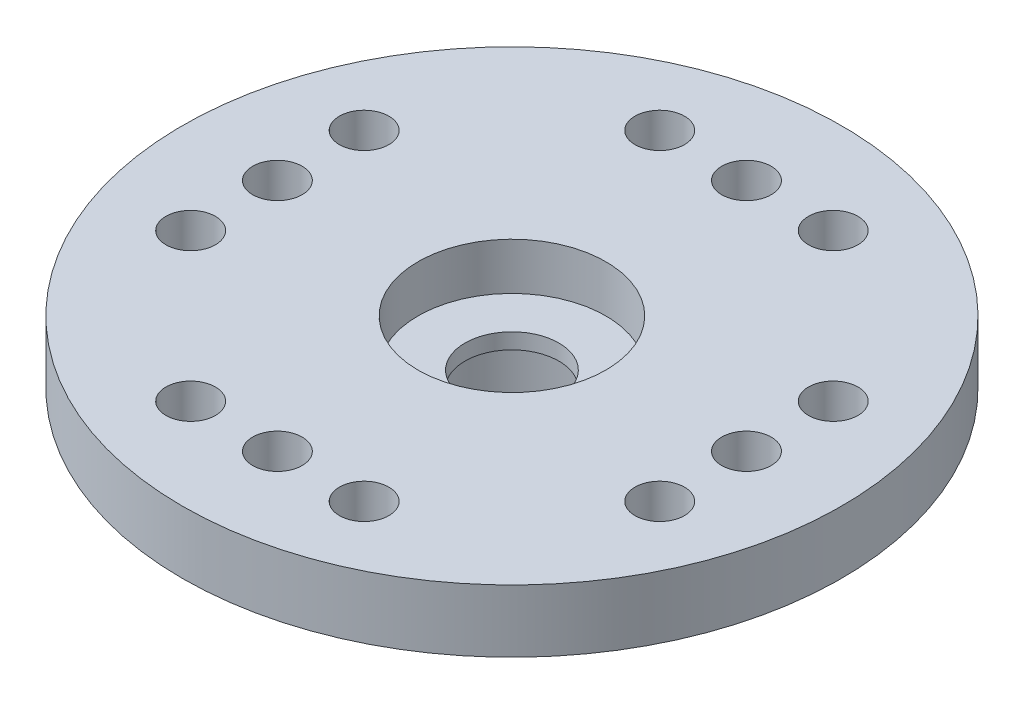
ISO-10303-21;
HEADER;
FILE_DESCRIPTION(('STEP AP214'),'2;1');
FILE_NAME('part.step','',(''),(''),'','','');
FILE_SCHEMA(('AUTOMOTIVE_DESIGN { 1 0 10303 214 1 1 1 1 }'));
ENDSEC;
DATA;
#1=APPLICATION_CONTEXT('core data for automotive mechanical design processes');
#2=APPLICATION_PROTOCOL_DEFINITION('international standard','automotive_design',2000,#1);
#3=PRODUCT_CONTEXT('',#1,'mechanical');
#4=PRODUCT('Part','Part','',(#3));
#5=PRODUCT_RELATED_PRODUCT_CATEGORY('part','',(#4));
#6=PRODUCT_DEFINITION_FORMATION('','',#4);
#7=PRODUCT_DEFINITION_CONTEXT('part definition',#1,'design');
#8=PRODUCT_DEFINITION('design','',#6,#7);
#9=PRODUCT_DEFINITION_SHAPE('','',#8);
#10=(LENGTH_UNIT() NAMED_UNIT(*) SI_UNIT(.MILLI.,.METRE.));
#11=(NAMED_UNIT(*) PLANE_ANGLE_UNIT() SI_UNIT($,.RADIAN.));
#12=(NAMED_UNIT(*) SI_UNIT($,.STERADIAN.) SOLID_ANGLE_UNIT());
#13=UNCERTAINTY_MEASURE_WITH_UNIT(LENGTH_MEASURE(1.E-05),#10,'distance_accuracy_value','');
#14=(GEOMETRIC_REPRESENTATION_CONTEXT(3) GLOBAL_UNCERTAINTY_ASSIGNED_CONTEXT((#13)) GLOBAL_UNIT_ASSIGNED_CONTEXT((#10,
#11,#12)) REPRESENTATION_CONTEXT('',''));
#15=CARTESIAN_POINT('',(0.,0.,0.));
#16=DIRECTION('',(0.,0.,1.));
#17=DIRECTION('',(1.,0.,0.));
#18=AXIS2_PLACEMENT_3D('',#15,#16,#17);
#19=CARTESIAN_POINT('',(0.,0.,0.));
#20=DIRECTION('',(0.,1.,0.));
#21=DIRECTION('',(0.,0.,1.));
#22=AXIS2_PLACEMENT_3D('',#19,#20,#21);
#23=CYLINDRICAL_SURFACE('',#22,1.5);
#24=CARTESIAN_POINT('',(0.,0.,0.));
#25=DIRECTION('',(0.,1.,0.));
#26=DIRECTION('',(0.,0.,1.));
#27=AXIS2_PLACEMENT_3D('',#24,#25,#26);
#28=CIRCLE('',#27,1.5);
#29=CARTESIAN_POINT('',(0.,0.,1.5));
#30=VERTEX_POINT('',#29);
#31=EDGE_CURVE('E57',#30,#30,#28,.T.);
#32=ORIENTED_EDGE('',*,*,#31,.F.);
#33=EDGE_LOOP('',(#32));
#34=FACE_BOUND('',#33,.T.);
#35=CARTESIAN_POINT('',(0.,0.5,0.));
#36=DIRECTION('',(0.,1.,0.));
#37=DIRECTION('',(0.,0.,1.));
#38=AXIS2_PLACEMENT_3D('',#35,#36,#37);
#39=CIRCLE('',#38,1.5);
#40=CARTESIAN_POINT('',(0.,0.5,1.5));
#41=VERTEX_POINT('',#40);
#42=EDGE_CURVE('E37',#41,#41,#39,.F.);
#43=ORIENTED_EDGE('',*,*,#42,.F.);
#44=EDGE_LOOP('',(#43));
#45=FACE_BOUND('',#44,.T.);
#46=ADVANCED_FACE('F33',(#34,#45),#23,.F.);
#47=CARTESIAN_POINT('',(0.,0.,0.));
#48=DIRECTION('',(0.,1.,0.));
#49=DIRECTION('',(0.,0.,1.));
#50=AXIS2_PLACEMENT_3D('',#47,#48,#49);
#51=PLANE('',#50);
#52=CARTESIAN_POINT('',(-7.49,0.,2.77));
#53=DIRECTION('',(0.,1.,0.));
#54=DIRECTION('',(0.,0.,1.));
#55=AXIS2_PLACEMENT_3D('',#52,#53,#54);
#56=CIRCLE('',#55,0.79);
#57=CARTESIAN_POINT('',(-7.49,0.,3.56));
#58=VERTEX_POINT('',#57);
#59=EDGE_CURVE('E132',#58,#58,#56,.T.);
#60=ORIENTED_EDGE('',*,*,#59,.T.);
#61=EDGE_LOOP('',(#60));
#62=FACE_BOUND('',#61,.T.);
#63=CARTESIAN_POINT('',(-7.49,0.,-2.77));
#64=DIRECTION('',(0.,1.,0.));
#65=DIRECTION('',(0.,0.,1.));
#66=AXIS2_PLACEMENT_3D('',#63,#64,#65);
#67=CIRCLE('',#66,0.79);
#68=CARTESIAN_POINT('',(-7.49,0.,-1.98));
#69=VERTEX_POINT('',#68);
#70=EDGE_CURVE('E126',#69,#69,#67,.T.);
#71=ORIENTED_EDGE('',*,*,#70,.T.);
#72=EDGE_LOOP('',(#71));
#73=FACE_BOUND('',#72,.T.);
#74=CARTESIAN_POINT('',(-7.49,0.,0.));
#75=DIRECTION('',(0.,1.,0.));
#76=DIRECTION('',(0.,0.,1.));
#77=AXIS2_PLACEMENT_3D('',#74,#75,#76);
#78=CIRCLE('',#77,0.79);
#79=CARTESIAN_POINT('',(-7.49,0.,0.79));
#80=VERTEX_POINT('',#79);
#81=EDGE_CURVE('E120',#80,#80,#78,.T.);
#82=ORIENTED_EDGE('',*,*,#81,.T.);
#83=EDGE_LOOP('',(#82));
#84=FACE_BOUND('',#83,.T.);
#85=CARTESIAN_POINT('',(-2.77,0.,7.49));
#86=DIRECTION('',(0.,1.,0.));
#87=DIRECTION('',(0.,0.,1.));
#88=AXIS2_PLACEMENT_3D('',#85,#86,#87);
#89=CIRCLE('',#88,0.79);
#90=CARTESIAN_POINT('',(-2.77,0.,8.28));
#91=VERTEX_POINT('',#90);
#92=EDGE_CURVE('E114',#91,#91,#89,.T.);
#93=ORIENTED_EDGE('',*,*,#92,.T.);
#94=EDGE_LOOP('',(#93));
#95=FACE_BOUND('',#94,.T.);
#96=CARTESIAN_POINT('',(2.77,0.,7.49));
#97=DIRECTION('',(0.,1.,0.));
#98=DIRECTION('',(0.,0.,1.));
#99=AXIS2_PLACEMENT_3D('',#96,#97,#98);
#100=CIRCLE('',#99,0.79);
#101=CARTESIAN_POINT('',(2.77,0.,8.28));
#102=VERTEX_POINT('',#101);
#103=EDGE_CURVE('E108',#102,#102,#100,.T.);
#104=ORIENTED_EDGE('',*,*,#103,.T.);
#105=EDGE_LOOP('',(#104));
#106=FACE_BOUND('',#105,.T.);
#107=CARTESIAN_POINT('',(0.,0.,7.49));
#108=DIRECTION('',(0.,1.,0.));
#109=DIRECTION('',(0.,0.,1.));
#110=AXIS2_PLACEMENT_3D('',#107,#108,#109);
#111=CIRCLE('',#110,0.79);
#112=CARTESIAN_POINT('',(0.,0.,8.28));
#113=VERTEX_POINT('',#112);
#114=EDGE_CURVE('E102',#113,#113,#111,.T.);
#115=ORIENTED_EDGE('',*,*,#114,.T.);
#116=EDGE_LOOP('',(#115));
#117=FACE_BOUND('',#116,.T.);
#118=CARTESIAN_POINT('',(7.49,0.,-2.77));
#119=DIRECTION('',(0.,1.,0.));
#120=DIRECTION('',(0.,0.,1.));
#121=AXIS2_PLACEMENT_3D('',#118,#119,#120);
#122=CIRCLE('',#121,0.790000000000001);
#123=CARTESIAN_POINT('',(7.49,0.,-1.98));
#124=VERTEX_POINT('',#123);
#125=EDGE_CURVE('E96',#124,#124,#122,.T.);
#126=ORIENTED_EDGE('',*,*,#125,.T.);
#127=EDGE_LOOP('',(#126));
#128=FACE_BOUND('',#127,.T.);
#129=CARTESIAN_POINT('',(7.49,0.,2.77));
#130=DIRECTION('',(0.,1.,0.));
#131=DIRECTION('',(0.,0.,1.));
#132=AXIS2_PLACEMENT_3D('',#129,#130,#131);
#133=CIRCLE('',#132,0.790000000000001);
#134=CARTESIAN_POINT('',(7.49,0.,3.56));
#135=VERTEX_POINT('',#134);
#136=EDGE_CURVE('E90',#135,#135,#133,.T.);
#137=ORIENTED_EDGE('',*,*,#136,.T.);
#138=EDGE_LOOP('',(#137));
#139=FACE_BOUND('',#138,.T.);
#140=CARTESIAN_POINT('',(7.49,0.,0.));
#141=DIRECTION('',(0.,1.,0.));
#142=DIRECTION('',(0.,0.,1.));
#143=AXIS2_PLACEMENT_3D('',#140,#141,#142);
#144=CIRCLE('',#143,0.790000000000001);
#145=CARTESIAN_POINT('',(7.49,0.,0.790000000000001));
#146=VERTEX_POINT('',#145);
#147=EDGE_CURVE('E84',#146,#146,#144,.T.);
#148=ORIENTED_EDGE('',*,*,#147,.T.);
#149=EDGE_LOOP('',(#148));
#150=FACE_BOUND('',#149,.T.);
#151=CARTESIAN_POINT('',(-2.77,0.,-7.49));
#152=DIRECTION('',(0.,1.,0.));
#153=DIRECTION('',(0.,0.,1.));
#154=AXIS2_PLACEMENT_3D('',#151,#152,#153);
#155=CIRCLE('',#154,0.79);
#156=CARTESIAN_POINT('',(-2.77,0.,-6.7));
#157=VERTEX_POINT('',#156);
#158=EDGE_CURVE('E78',#157,#157,#155,.T.);
#159=ORIENTED_EDGE('',*,*,#158,.T.);
#160=EDGE_LOOP('',(#159));
#161=FACE_BOUND('',#160,.T.);
#162=CARTESIAN_POINT('',(2.77,0.,-7.49));
#163=DIRECTION('',(0.,1.,0.));
#164=DIRECTION('',(0.,0.,1.));
#165=AXIS2_PLACEMENT_3D('',#162,#163,#164);
#166=CIRCLE('',#165,0.79);
#167=CARTESIAN_POINT('',(2.77,0.,-6.7));
#168=VERTEX_POINT('',#167);
#169=EDGE_CURVE('E72',#168,#168,#166,.T.);
#170=ORIENTED_EDGE('',*,*,#169,.T.);
#171=EDGE_LOOP('',(#170));
#172=FACE_BOUND('',#171,.T.);
#173=CARTESIAN_POINT('',(0.,0.,-7.49));
#174=DIRECTION('',(0.,1.,0.));
#175=DIRECTION('',(0.,0.,1.));
#176=AXIS2_PLACEMENT_3D('',#173,#174,#175);
#177=CIRCLE('',#176,0.79);
#178=CARTESIAN_POINT('',(0.,0.,-6.7));
#179=VERTEX_POINT('',#178);
#180=EDGE_CURVE('E66',#179,#179,#177,.T.);
#181=ORIENTED_EDGE('',*,*,#180,.T.);
#182=EDGE_LOOP('',(#181));
#183=FACE_BOUND('',#182,.T.);
#184=CARTESIAN_POINT('',(0.,0.,0.));
#185=DIRECTION('',(0.,1.,0.));
#186=DIRECTION('',(0.,0.,1.));
#187=AXIS2_PLACEMENT_3D('',#184,#185,#186);
#188=CIRCLE('',#187,10.525);
#189=CARTESIAN_POINT('',(0.,0.,10.525));
#190=VERTEX_POINT('',#189);
#191=EDGE_CURVE('E45',#190,#190,#188,.T.);
#192=ORIENTED_EDGE('',*,*,#191,.F.);
#193=EDGE_LOOP('',(#192));
#194=FACE_BOUND('',#193,.T.);
#195=CARTESIAN_POINT('',(0.,0.,0.));
#196=DIRECTION('',(0.,1.,0.));
#197=DIRECTION('',(0.,0.,1.));
#198=AXIS2_PLACEMENT_3D('',#195,#196,#197);
#199=CIRCLE('',#198,4.1);
#200=CARTESIAN_POINT('',(0.,0.,4.1));
#201=VERTEX_POINT('',#200);
#202=EDGE_CURVE('E10',#201,#201,#199,.F.);
#203=ORIENTED_EDGE('',*,*,#202,.F.);
#204=EDGE_LOOP('',(#203));
#205=FACE_BOUND('',#204,.T.);
#206=ADVANCED_FACE('F141',(#62,#73,#84,#95,#106,#117,#128,#139,#150,#161,#172,#183,#194,#205),
#51,.F.);
#207=CARTESIAN_POINT('',(0.,2.,0.));
#208=DIRECTION('',(0.,-1.,0.));
#209=DIRECTION('',(0.,0.,-1.));
#210=AXIS2_PLACEMENT_3D('',#207,#208,#209);
#211=CYLINDRICAL_SURFACE('',#210,10.525);
#212=CARTESIAN_POINT('',(0.,2.,0.));
#213=DIRECTION('',(0.,1.,0.));
#214=DIRECTION('',(0.,0.,1.));
#215=AXIS2_PLACEMENT_3D('',#212,#213,#214);
#216=CIRCLE('',#215,10.525);
#217=CARTESIAN_POINT('',(0.,2.,10.525));
#218=VERTEX_POINT('',#217);
#219=EDGE_CURVE('E41',#218,#218,#216,.T.);
#220=ORIENTED_EDGE('',*,*,#219,.F.);
#221=EDGE_LOOP('',(#220));
#222=FACE_BOUND('',#221,.T.);
#223=ORIENTED_EDGE('',*,*,#191,.T.);
#224=EDGE_LOOP('',(#223));
#225=FACE_BOUND('',#224,.T.);
#226=ADVANCED_FACE('F35',(#222,#225),#211,.T.);
#227=CARTESIAN_POINT('',(0.,2.,0.));
#228=DIRECTION('',(0.,1.,0.));
#229=DIRECTION('',(0.,0.,1.));
#230=AXIS2_PLACEMENT_3D('',#227,#228,#229);
#231=PLANE('',#230);
#232=CARTESIAN_POINT('',(-7.49,2.,2.77));
#233=DIRECTION('',(0.,1.,0.));
#234=DIRECTION('',(0.,0.,1.));
#235=AXIS2_PLACEMENT_3D('',#232,#233,#234);
#236=CIRCLE('',#235,0.79);
#237=CARTESIAN_POINT('',(-7.49,2.,3.56));
#238=VERTEX_POINT('',#237);
#239=EDGE_CURVE('E135',#238,#238,#236,.T.);
#240=ORIENTED_EDGE('',*,*,#239,.F.);
#241=EDGE_LOOP('',(#240));
#242=FACE_BOUND('',#241,.T.);
#243=CARTESIAN_POINT('',(-7.49,2.,-2.77));
#244=DIRECTION('',(0.,1.,0.));
#245=DIRECTION('',(0.,0.,1.));
#246=AXIS2_PLACEMENT_3D('',#243,#244,#245);
#247=CIRCLE('',#246,0.79);
#248=CARTESIAN_POINT('',(-7.49,2.,-1.98));
#249=VERTEX_POINT('',#248);
#250=EDGE_CURVE('E129',#249,#249,#247,.T.);
#251=ORIENTED_EDGE('',*,*,#250,.F.);
#252=EDGE_LOOP('',(#251));
#253=FACE_BOUND('',#252,.T.);
#254=CARTESIAN_POINT('',(-7.49,2.,0.));
#255=DIRECTION('',(0.,1.,0.));
#256=DIRECTION('',(0.,0.,1.));
#257=AXIS2_PLACEMENT_3D('',#254,#255,#256);
#258=CIRCLE('',#257,0.79);
#259=CARTESIAN_POINT('',(-7.49,2.,0.79));
#260=VERTEX_POINT('',#259);
#261=EDGE_CURVE('E123',#260,#260,#258,.T.);
#262=ORIENTED_EDGE('',*,*,#261,.F.);
#263=EDGE_LOOP('',(#262));
#264=FACE_BOUND('',#263,.T.);
#265=CARTESIAN_POINT('',(-2.77,2.,7.49));
#266=DIRECTION('',(0.,1.,0.));
#267=DIRECTION('',(0.,0.,1.));
#268=AXIS2_PLACEMENT_3D('',#265,#266,#267);
#269=CIRCLE('',#268,0.79);
#270=CARTESIAN_POINT('',(-2.77,2.,8.28));
#271=VERTEX_POINT('',#270);
#272=EDGE_CURVE('E117',#271,#271,#269,.T.);
#273=ORIENTED_EDGE('',*,*,#272,.F.);
#274=EDGE_LOOP('',(#273));
#275=FACE_BOUND('',#274,.T.);
#276=CARTESIAN_POINT('',(2.77,2.,7.49));
#277=DIRECTION('',(0.,1.,0.));
#278=DIRECTION('',(0.,0.,1.));
#279=AXIS2_PLACEMENT_3D('',#276,#277,#278);
#280=CIRCLE('',#279,0.79);
#281=CARTESIAN_POINT('',(2.77,2.,8.28));
#282=VERTEX_POINT('',#281);
#283=EDGE_CURVE('E111',#282,#282,#280,.T.);
#284=ORIENTED_EDGE('',*,*,#283,.F.);
#285=EDGE_LOOP('',(#284));
#286=FACE_BOUND('',#285,.T.);
#287=CARTESIAN_POINT('',(0.,2.,7.49));
#288=DIRECTION('',(0.,1.,0.));
#289=DIRECTION('',(0.,0.,1.));
#290=AXIS2_PLACEMENT_3D('',#287,#288,#289);
#291=CIRCLE('',#290,0.79);
#292=CARTESIAN_POINT('',(0.,2.,8.28));
#293=VERTEX_POINT('',#292);
#294=EDGE_CURVE('E105',#293,#293,#291,.T.);
#295=ORIENTED_EDGE('',*,*,#294,.F.);
#296=EDGE_LOOP('',(#295));
#297=FACE_BOUND('',#296,.T.);
#298=CARTESIAN_POINT('',(7.49,2.,-2.77));
#299=DIRECTION('',(0.,1.,0.));
#300=DIRECTION('',(0.,0.,1.));
#301=AXIS2_PLACEMENT_3D('',#298,#299,#300);
#302=CIRCLE('',#301,0.790000000000001);
#303=CARTESIAN_POINT('',(7.49,2.,-1.98));
#304=VERTEX_POINT('',#303);
#305=EDGE_CURVE('E99',#304,#304,#302,.T.);
#306=ORIENTED_EDGE('',*,*,#305,.F.);
#307=EDGE_LOOP('',(#306));
#308=FACE_BOUND('',#307,.T.);
#309=CARTESIAN_POINT('',(7.49,2.,2.77));
#310=DIRECTION('',(0.,1.,0.));
#311=DIRECTION('',(0.,0.,1.));
#312=AXIS2_PLACEMENT_3D('',#309,#310,#311);
#313=CIRCLE('',#312,0.790000000000001);
#314=CARTESIAN_POINT('',(7.49,2.,3.56));
#315=VERTEX_POINT('',#314);
#316=EDGE_CURVE('E93',#315,#315,#313,.T.);
#317=ORIENTED_EDGE('',*,*,#316,.F.);
#318=EDGE_LOOP('',(#317));
#319=FACE_BOUND('',#318,.T.);
#320=CARTESIAN_POINT('',(7.49,2.,0.));
#321=DIRECTION('',(0.,1.,0.));
#322=DIRECTION('',(0.,0.,1.));
#323=AXIS2_PLACEMENT_3D('',#320,#321,#322);
#324=CIRCLE('',#323,0.790000000000001);
#325=CARTESIAN_POINT('',(7.49,2.,0.790000000000001));
#326=VERTEX_POINT('',#325);
#327=EDGE_CURVE('E87',#326,#326,#324,.T.);
#328=ORIENTED_EDGE('',*,*,#327,.F.);
#329=EDGE_LOOP('',(#328));
#330=FACE_BOUND('',#329,.T.);
#331=CARTESIAN_POINT('',(-2.77,2.,-7.49));
#332=DIRECTION('',(0.,1.,0.));
#333=DIRECTION('',(0.,0.,1.));
#334=AXIS2_PLACEMENT_3D('',#331,#332,#333);
#335=CIRCLE('',#334,0.79);
#336=CARTESIAN_POINT('',(-2.77,2.,-6.7));
#337=VERTEX_POINT('',#336);
#338=EDGE_CURVE('E81',#337,#337,#335,.T.);
#339=ORIENTED_EDGE('',*,*,#338,.F.);
#340=EDGE_LOOP('',(#339));
#341=FACE_BOUND('',#340,.T.);
#342=CARTESIAN_POINT('',(2.77,2.,-7.49));
#343=DIRECTION('',(0.,1.,0.));
#344=DIRECTION('',(0.,0.,1.));
#345=AXIS2_PLACEMENT_3D('',#342,#343,#344);
#346=CIRCLE('',#345,0.79);
#347=CARTESIAN_POINT('',(2.77,2.,-6.7));
#348=VERTEX_POINT('',#347);
#349=EDGE_CURVE('E75',#348,#348,#346,.T.);
#350=ORIENTED_EDGE('',*,*,#349,.F.);
#351=EDGE_LOOP('',(#350));
#352=FACE_BOUND('',#351,.T.);
#353=CARTESIAN_POINT('',(0.,2.,-7.49));
#354=DIRECTION('',(0.,1.,0.));
#355=DIRECTION('',(0.,0.,1.));
#356=AXIS2_PLACEMENT_3D('',#353,#354,#355);
#357=CIRCLE('',#356,0.79);
#358=CARTESIAN_POINT('',(0.,2.,-6.7));
#359=VERTEX_POINT('',#358);
#360=EDGE_CURVE('E69',#359,#359,#357,.T.);
#361=ORIENTED_EDGE('',*,*,#360,.F.);
#362=EDGE_LOOP('',(#361));
#363=FACE_BOUND('',#362,.T.);
#364=CARTESIAN_POINT('',(0.,2.,0.));
#365=DIRECTION('',(0.,1.,0.));
#366=DIRECTION('',(0.,0.,1.));
#367=AXIS2_PLACEMENT_3D('',#364,#365,#366);
#368=CIRCLE('',#367,3.);
#369=CARTESIAN_POINT('',(0.,2.,3.));
#370=VERTEX_POINT('',#369);
#371=EDGE_CURVE('E62',#370,#370,#368,.T.);
#372=ORIENTED_EDGE('',*,*,#371,.F.);
#373=EDGE_LOOP('',(#372));
#374=FACE_BOUND('',#373,.T.);
#375=ORIENTED_EDGE('',*,*,#219,.T.);
#376=EDGE_LOOP('',(#375));
#377=FACE_BOUND('',#376,.T.);
#378=ADVANCED_FACE('F151',(#242,#253,#264,#275,#286,#297,#308,#319,#330,#341,#352,#363,#374,
#377),#231,.T.);
#379=CARTESIAN_POINT('',(0.,-3.7,0.));
#380=DIRECTION('',(0.,1.,0.));
#381=DIRECTION('',(0.,0.,1.));
#382=AXIS2_PLACEMENT_3D('',#379,#380,#381);
#383=CYLINDRICAL_SURFACE('',#382,4.1);
#384=CARTESIAN_POINT('',(0.,-3.7,0.));
#385=DIRECTION('',(0.,-1.,0.));
#386=DIRECTION('',(0.,0.,-1.));
#387=AXIS2_PLACEMENT_3D('',#384,#385,#386);
#388=CIRCLE('',#387,4.1);
#389=CARTESIAN_POINT('',(0.,-3.7,-4.1));
#390=VERTEX_POINT('',#389);
#391=EDGE_CURVE('E49',#390,#390,#388,.T.);
#392=ORIENTED_EDGE('',*,*,#391,.F.);
#393=EDGE_LOOP('',(#392));
#394=FACE_BOUND('',#393,.T.);
#395=ORIENTED_EDGE('',*,*,#202,.T.);
#396=EDGE_LOOP('',(#395));
#397=FACE_BOUND('',#396,.T.);
#398=ADVANCED_FACE('F154',(#394,#397),#383,.T.);
#399=CARTESIAN_POINT('',(0.,-3.7,0.));
#400=DIRECTION('',(0.,-1.,0.));
#401=DIRECTION('',(0.,0.,-1.));
#402=AXIS2_PLACEMENT_3D('',#399,#400,#401);
#403=PLANE('',#402);
#404=CARTESIAN_POINT('',(0.,-3.7,0.));
#405=DIRECTION('',(0.,-1.,0.));
#406=DIRECTION('',(0.,0.,-1.));
#407=AXIS2_PLACEMENT_3D('',#404,#405,#406);
#408=CIRCLE('',#407,2.97);
#409=CARTESIAN_POINT('',(0.,-3.7,-2.97));
#410=VERTEX_POINT('',#409);
#411=EDGE_CURVE('E54',#410,#410,#408,.T.);
#412=ORIENTED_EDGE('',*,*,#411,.F.);
#413=EDGE_LOOP('',(#412));
#414=FACE_BOUND('',#413,.T.);
#415=ORIENTED_EDGE('',*,*,#391,.T.);
#416=EDGE_LOOP('',(#415));
#417=FACE_BOUND('',#416,.T.);
#418=ADVANCED_FACE('F196',(#414,#417),#403,.T.);
#419=CARTESIAN_POINT('',(0.,0.,0.));
#420=DIRECTION('',(0.,-1.,0.));
#421=DIRECTION('',(0.,0.,-1.));
#422=AXIS2_PLACEMENT_3D('',#419,#420,#421);
#423=CYLINDRICAL_SURFACE('',#422,2.97);
#424=CARTESIAN_POINT('',(0.,0.,0.));
#425=DIRECTION('',(0.,-1.,0.));
#426=DIRECTION('',(0.,0.,-1.));
#427=AXIS2_PLACEMENT_3D('',#424,#425,#426);
#428=CIRCLE('',#427,2.97);
#429=CARTESIAN_POINT('',(0.,0.,-2.97));
#430=VERTEX_POINT('',#429);
#431=EDGE_CURVE('E53',#430,#430,#428,.T.);
#432=ORIENTED_EDGE('',*,*,#431,.F.);
#433=EDGE_LOOP('',(#432));
#434=FACE_BOUND('',#433,.T.);
#435=ORIENTED_EDGE('',*,*,#411,.T.);
#436=EDGE_LOOP('',(#435));
#437=FACE_BOUND('',#436,.T.);
#438=ADVANCED_FACE('F200',(#434,#437),#423,.F.);
#439=CARTESIAN_POINT('',(0.,0.,0.));
#440=DIRECTION('',(0.,-1.,0.));
#441=DIRECTION('',(0.,0.,-1.));
#442=AXIS2_PLACEMENT_3D('',#439,#440,#441);
#443=PLANE('',#442);
#444=ORIENTED_EDGE('',*,*,#31,.T.);
#445=EDGE_LOOP('',(#444));
#446=FACE_BOUND('',#445,.T.);
#447=ORIENTED_EDGE('',*,*,#431,.T.);
#448=EDGE_LOOP('',(#447));
#449=FACE_BOUND('',#448,.T.);
#450=ADVANCED_FACE('F204',(#446,#449),#443,.T.);
#451=CARTESIAN_POINT('',(0.,0.5,0.));
#452=DIRECTION('',(0.,1.,0.));
#453=DIRECTION('',(0.,0.,1.));
#454=AXIS2_PLACEMENT_3D('',#451,#452,#453);
#455=PLANE('',#454);
#456=CARTESIAN_POINT('',(0.,0.5,0.));
#457=DIRECTION('',(0.,1.,0.));
#458=DIRECTION('',(0.,0.,1.));
#459=AXIS2_PLACEMENT_3D('',#456,#457,#458);
#460=CIRCLE('',#459,3.);
#461=CARTESIAN_POINT('',(0.,0.5,3.));
#462=VERTEX_POINT('',#461);
#463=EDGE_CURVE('E65',#462,#462,#460,.T.);
#464=ORIENTED_EDGE('',*,*,#463,.T.);
#465=EDGE_LOOP('',(#464));
#466=FACE_BOUND('',#465,.T.);
#467=ORIENTED_EDGE('',*,*,#42,.T.);
#468=EDGE_LOOP('',(#467));
#469=FACE_BOUND('',#468,.T.);
#470=ADVANCED_FACE('F207',(#466,#469),#455,.T.);
#471=CARTESIAN_POINT('',(0.,0.5,0.));
#472=DIRECTION('',(0.,1.,0.));
#473=DIRECTION('',(0.,0.,1.));
#474=AXIS2_PLACEMENT_3D('',#471,#472,#473);
#475=CYLINDRICAL_SURFACE('',#474,3.);
#476=ORIENTED_EDGE('',*,*,#463,.F.);
#477=EDGE_LOOP('',(#476));
#478=FACE_BOUND('',#477,.T.);
#479=ORIENTED_EDGE('',*,*,#371,.T.);
#480=EDGE_LOOP('',(#479));
#481=FACE_BOUND('',#480,.T.);
#482=ADVANCED_FACE('F210',(#478,#481),#475,.F.);
#483=CARTESIAN_POINT('',(0.,0.,-7.49));
#484=DIRECTION('',(0.,1.,0.));
#485=DIRECTION('',(0.,0.,1.));
#486=AXIS2_PLACEMENT_3D('',#483,#484,#485);
#487=CYLINDRICAL_SURFACE('',#486,0.79);
#488=ORIENTED_EDGE('',*,*,#180,.F.);
#489=EDGE_LOOP('',(#488));
#490=FACE_BOUND('',#489,.T.);
#491=ORIENTED_EDGE('',*,*,#360,.T.);
#492=EDGE_LOOP('',(#491));
#493=FACE_BOUND('',#492,.T.);
#494=ADVANCED_FACE('F213',(#490,#493),#487,.F.);
#495=CARTESIAN_POINT('',(2.77,0.,-7.49));
#496=DIRECTION('',(0.,1.,0.));
#497=DIRECTION('',(0.,0.,1.));
#498=AXIS2_PLACEMENT_3D('',#495,#496,#497);
#499=CYLINDRICAL_SURFACE('',#498,0.79);
#500=ORIENTED_EDGE('',*,*,#169,.F.);
#501=EDGE_LOOP('',(#500));
#502=FACE_BOUND('',#501,.T.);
#503=ORIENTED_EDGE('',*,*,#349,.T.);
#504=EDGE_LOOP('',(#503));
#505=FACE_BOUND('',#504,.T.);
#506=ADVANCED_FACE('F220',(#502,#505),#499,.F.);
#507=CARTESIAN_POINT('',(-2.77,0.,-7.49));
#508=DIRECTION('',(0.,1.,0.));
#509=DIRECTION('',(0.,0.,1.));
#510=AXIS2_PLACEMENT_3D('',#507,#508,#509);
#511=CYLINDRICAL_SURFACE('',#510,0.79);
#512=ORIENTED_EDGE('',*,*,#158,.F.);
#513=EDGE_LOOP('',(#512));
#514=FACE_BOUND('',#513,.T.);
#515=ORIENTED_EDGE('',*,*,#338,.T.);
#516=EDGE_LOOP('',(#515));
#517=FACE_BOUND('',#516,.T.);
#518=ADVANCED_FACE('F224',(#514,#517),#511,.F.);
#519=CARTESIAN_POINT('',(7.49,0.,0.));
#520=DIRECTION('',(0.,1.,0.));
#521=DIRECTION('',(0.,0.,1.));
#522=AXIS2_PLACEMENT_3D('',#519,#520,#521);
#523=CYLINDRICAL_SURFACE('',#522,0.790000000000001);
#524=ORIENTED_EDGE('',*,*,#147,.F.);
#525=EDGE_LOOP('',(#524));
#526=FACE_BOUND('',#525,.T.);
#527=ORIENTED_EDGE('',*,*,#327,.T.);
#528=EDGE_LOOP('',(#527));
#529=FACE_BOUND('',#528,.T.);
#530=ADVANCED_FACE('F228',(#526,#529),#523,.F.);
#531=CARTESIAN_POINT('',(7.49,0.,2.77));
#532=DIRECTION('',(0.,1.,0.));
#533=DIRECTION('',(0.,0.,1.));
#534=AXIS2_PLACEMENT_3D('',#531,#532,#533);
#535=CYLINDRICAL_SURFACE('',#534,0.790000000000001);
#536=ORIENTED_EDGE('',*,*,#136,.F.);
#537=EDGE_LOOP('',(#536));
#538=FACE_BOUND('',#537,.T.);
#539=ORIENTED_EDGE('',*,*,#316,.T.);
#540=EDGE_LOOP('',(#539));
#541=FACE_BOUND('',#540,.T.);
#542=ADVANCED_FACE('F232',(#538,#541),#535,.F.);
#543=CARTESIAN_POINT('',(7.49,0.,-2.77));
#544=DIRECTION('',(0.,1.,0.));
#545=DIRECTION('',(0.,0.,1.));
#546=AXIS2_PLACEMENT_3D('',#543,#544,#545);
#547=CYLINDRICAL_SURFACE('',#546,0.790000000000001);
#548=ORIENTED_EDGE('',*,*,#125,.F.);
#549=EDGE_LOOP('',(#548));
#550=FACE_BOUND('',#549,.T.);
#551=ORIENTED_EDGE('',*,*,#305,.T.);
#552=EDGE_LOOP('',(#551));
#553=FACE_BOUND('',#552,.T.);
#554=ADVANCED_FACE('F236',(#550,#553),#547,.F.);
#555=CARTESIAN_POINT('',(0.,0.,7.49));
#556=DIRECTION('',(0.,1.,0.));
#557=DIRECTION('',(0.,0.,1.));
#558=AXIS2_PLACEMENT_3D('',#555,#556,#557);
#559=CYLINDRICAL_SURFACE('',#558,0.79);
#560=ORIENTED_EDGE('',*,*,#114,.F.);
#561=EDGE_LOOP('',(#560));
#562=FACE_BOUND('',#561,.T.);
#563=ORIENTED_EDGE('',*,*,#294,.T.);
#564=EDGE_LOOP('',(#563));
#565=FACE_BOUND('',#564,.T.);
#566=ADVANCED_FACE('F240',(#562,#565),#559,.F.);
#567=CARTESIAN_POINT('',(2.77,0.,7.49));
#568=DIRECTION('',(0.,1.,0.));
#569=DIRECTION('',(0.,0.,1.));
#570=AXIS2_PLACEMENT_3D('',#567,#568,#569);
#571=CYLINDRICAL_SURFACE('',#570,0.79);
#572=ORIENTED_EDGE('',*,*,#103,.F.);
#573=EDGE_LOOP('',(#572));
#574=FACE_BOUND('',#573,.T.);
#575=ORIENTED_EDGE('',*,*,#283,.T.);
#576=EDGE_LOOP('',(#575));
#577=FACE_BOUND('',#576,.T.);
#578=ADVANCED_FACE('F244',(#574,#577),#571,.F.);
#579=CARTESIAN_POINT('',(-2.77,0.,7.49));
#580=DIRECTION('',(0.,1.,0.));
#581=DIRECTION('',(0.,0.,1.));
#582=AXIS2_PLACEMENT_3D('',#579,#580,#581);
#583=CYLINDRICAL_SURFACE('',#582,0.79);
#584=ORIENTED_EDGE('',*,*,#92,.F.);
#585=EDGE_LOOP('',(#584));
#586=FACE_BOUND('',#585,.T.);
#587=ORIENTED_EDGE('',*,*,#272,.T.);
#588=EDGE_LOOP('',(#587));
#589=FACE_BOUND('',#588,.T.);
#590=ADVANCED_FACE('F248',(#586,#589),#583,.F.);
#591=CARTESIAN_POINT('',(-7.49,0.,0.));
#592=DIRECTION('',(0.,1.,0.));
#593=DIRECTION('',(0.,0.,1.));
#594=AXIS2_PLACEMENT_3D('',#591,#592,#593);
#595=CYLINDRICAL_SURFACE('',#594,0.79);
#596=ORIENTED_EDGE('',*,*,#81,.F.);
#597=EDGE_LOOP('',(#596));
#598=FACE_BOUND('',#597,.T.);
#599=ORIENTED_EDGE('',*,*,#261,.T.);
#600=EDGE_LOOP('',(#599));
#601=FACE_BOUND('',#600,.T.);
#602=ADVANCED_FACE('F252',(#598,#601),#595,.F.);
#603=CARTESIAN_POINT('',(-7.49,0.,-2.77));
#604=DIRECTION('',(0.,1.,0.));
#605=DIRECTION('',(0.,0.,1.));
#606=AXIS2_PLACEMENT_3D('',#603,#604,#605);
#607=CYLINDRICAL_SURFACE('',#606,0.79);
#608=ORIENTED_EDGE('',*,*,#70,.F.);
#609=EDGE_LOOP('',(#608));
#610=FACE_BOUND('',#609,.T.);
#611=ORIENTED_EDGE('',*,*,#250,.T.);
#612=EDGE_LOOP('',(#611));
#613=FACE_BOUND('',#612,.T.);
#614=ADVANCED_FACE('F147',(#610,#613),#607,.F.);
#615=CARTESIAN_POINT('',(-7.49,0.,2.77));
#616=DIRECTION('',(0.,1.,0.));
#617=DIRECTION('',(0.,0.,1.));
#618=AXIS2_PLACEMENT_3D('',#615,#616,#617);
#619=CYLINDRICAL_SURFACE('',#618,0.79);
#620=ORIENTED_EDGE('',*,*,#59,.F.);
#621=EDGE_LOOP('',(#620));
#622=FACE_BOUND('',#621,.T.);
#623=ORIENTED_EDGE('',*,*,#239,.T.);
#624=EDGE_LOOP('',(#623));
#625=FACE_BOUND('',#624,.T.);
#626=ADVANCED_FACE('F144',(#622,#625),#619,.F.);
#627=CLOSED_SHELL('',(#46,#206,#226,#378,#398,#418,#438,#450,#470,#482,#494,#506,#518,#530,#542,
#554,#566,#578,#590,#602,#614,#626));
#628=MANIFOLD_SOLID_BREP('B2',#627);
#629=ADVANCED_BREP_SHAPE_REPRESENTATION('',(#18,#628),#14);
#630=SHAPE_DEFINITION_REPRESENTATION(#9,#629);
ENDSEC;
END-ISO-10303-21;
